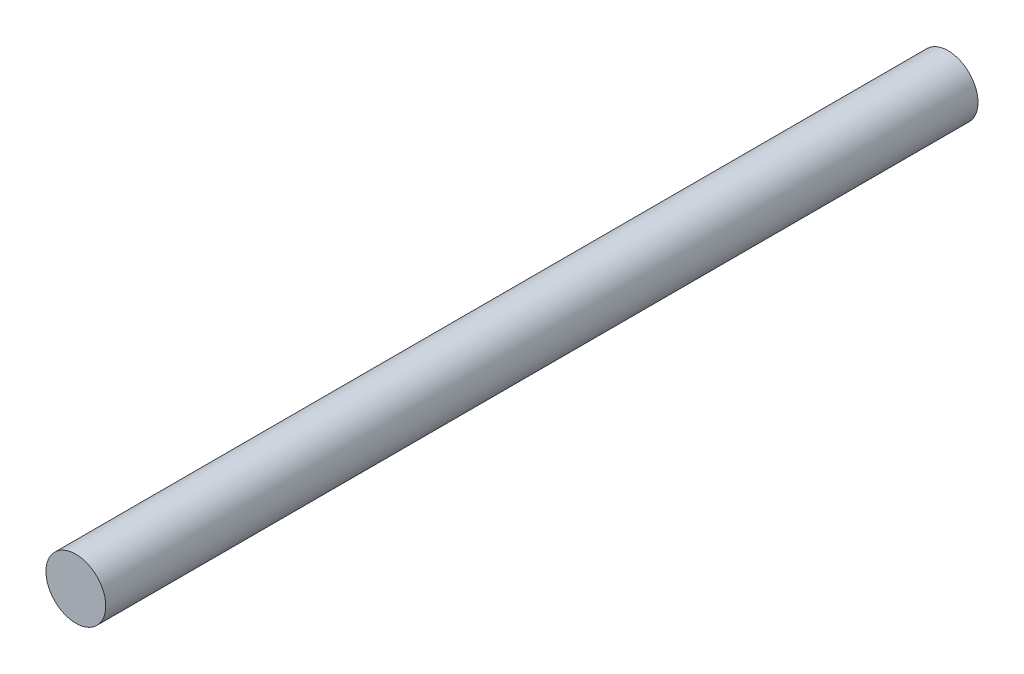
ISO-10303-21;
HEADER;
FILE_DESCRIPTION(('STEP AP214'),'2;1');
FILE_NAME('part.step','',(''),(''),'','','');
FILE_SCHEMA(('AUTOMOTIVE_DESIGN { 1 0 10303 214 1 1 1 1 }'));
ENDSEC;
DATA;
#1=APPLICATION_CONTEXT('core data for automotive mechanical design processes');
#2=APPLICATION_PROTOCOL_DEFINITION('international standard','automotive_design',2000,#1);
#3=PRODUCT_CONTEXT('',#1,'mechanical');
#4=PRODUCT('Part','Part','',(#3));
#5=PRODUCT_RELATED_PRODUCT_CATEGORY('part','',(#4));
#6=PRODUCT_DEFINITION_FORMATION('','',#4);
#7=PRODUCT_DEFINITION_CONTEXT('part definition',#1,'design');
#8=PRODUCT_DEFINITION('design','',#6,#7);
#9=PRODUCT_DEFINITION_SHAPE('','',#8);
#10=(LENGTH_UNIT() NAMED_UNIT(*) SI_UNIT(.MILLI.,.METRE.));
#11=(NAMED_UNIT(*) PLANE_ANGLE_UNIT() SI_UNIT($,.RADIAN.));
#12=(NAMED_UNIT(*) SI_UNIT($,.STERADIAN.) SOLID_ANGLE_UNIT());
#13=UNCERTAINTY_MEASURE_WITH_UNIT(LENGTH_MEASURE(1.E-05),#10,'distance_accuracy_value','');
#14=(GEOMETRIC_REPRESENTATION_CONTEXT(3) GLOBAL_UNCERTAINTY_ASSIGNED_CONTEXT((#13)) GLOBAL_UNIT_ASSIGNED_CONTEXT((#10,
#11,#12)) REPRESENTATION_CONTEXT('',''));
#15=CARTESIAN_POINT('',(0.,0.,0.));
#16=DIRECTION('',(0.,0.,1.));
#17=DIRECTION('',(1.,0.,0.));
#18=AXIS2_PLACEMENT_3D('',#15,#16,#17);
#19=CARTESIAN_POINT('',(0.,0.,35.));
#20=DIRECTION('',(0.,0.,-1.));
#21=DIRECTION('',(-1.,0.,0.));
#22=AXIS2_PLACEMENT_3D('',#19,#20,#21);
#23=CYLINDRICAL_SURFACE('',#22,2.4);
#24=CARTESIAN_POINT('',(0.,0.,35.));
#25=DIRECTION('',(0.,0.,1.));
#26=DIRECTION('',(1.,0.,0.));
#27=AXIS2_PLACEMENT_3D('',#24,#25,#26);
#28=CIRCLE('',#27,2.4);
#29=CARTESIAN_POINT('',(2.4,0.,35.));
#30=VERTEX_POINT('',#29);
#31=EDGE_CURVE('E10',#30,#30,#28,.T.);
#32=ORIENTED_EDGE('',*,*,#31,.F.);
#33=EDGE_LOOP('',(#32));
#34=FACE_BOUND('',#33,.T.);
#35=CARTESIAN_POINT('',(0.,0.,-35.));
#36=DIRECTION('',(0.,0.,1.));
#37=DIRECTION('',(1.,0.,0.));
#38=AXIS2_PLACEMENT_3D('',#35,#36,#37);
#39=CIRCLE('',#38,2.4);
#40=CARTESIAN_POINT('',(2.4,0.,-35.));
#41=VERTEX_POINT('',#40);
#42=EDGE_CURVE('E38',#41,#41,#39,.T.);
#43=ORIENTED_EDGE('',*,*,#42,.T.);
#44=EDGE_LOOP('',(#43));
#45=FACE_BOUND('',#44,.T.);
#46=ADVANCED_FACE('F35',(#34,#45),#23,.T.);
#47=CARTESIAN_POINT('',(0.,0.,35.));
#48=DIRECTION('',(0.,0.,1.));
#49=DIRECTION('',(1.,0.,0.));
#50=AXIS2_PLACEMENT_3D('',#47,#48,#49);
#51=PLANE('',#50);
#52=ORIENTED_EDGE('',*,*,#31,.T.);
#53=EDGE_LOOP('',(#52));
#54=FACE_BOUND('',#53,.T.);
#55=ADVANCED_FACE('F50',(#54),#51,.T.);
#56=CARTESIAN_POINT('',(0.,0.,-35.));
#57=DIRECTION('',(0.,0.,1.));
#58=DIRECTION('',(1.,0.,0.));
#59=AXIS2_PLACEMENT_3D('',#56,#57,#58);
#60=PLANE('',#59);
#61=ORIENTED_EDGE('',*,*,#42,.F.);
#62=EDGE_LOOP('',(#61));
#63=FACE_BOUND('',#62,.T.);
#64=ADVANCED_FACE('F48',(#63),#60,.F.);
#65=CLOSED_SHELL('',(#46,#55,#64));
#66=MANIFOLD_SOLID_BREP('B2',#65);
#67=ADVANCED_BREP_SHAPE_REPRESENTATION('',(#18,#66),#14);
#68=SHAPE_DEFINITION_REPRESENTATION(#9,#67);
ENDSEC;
END-ISO-10303-21;
